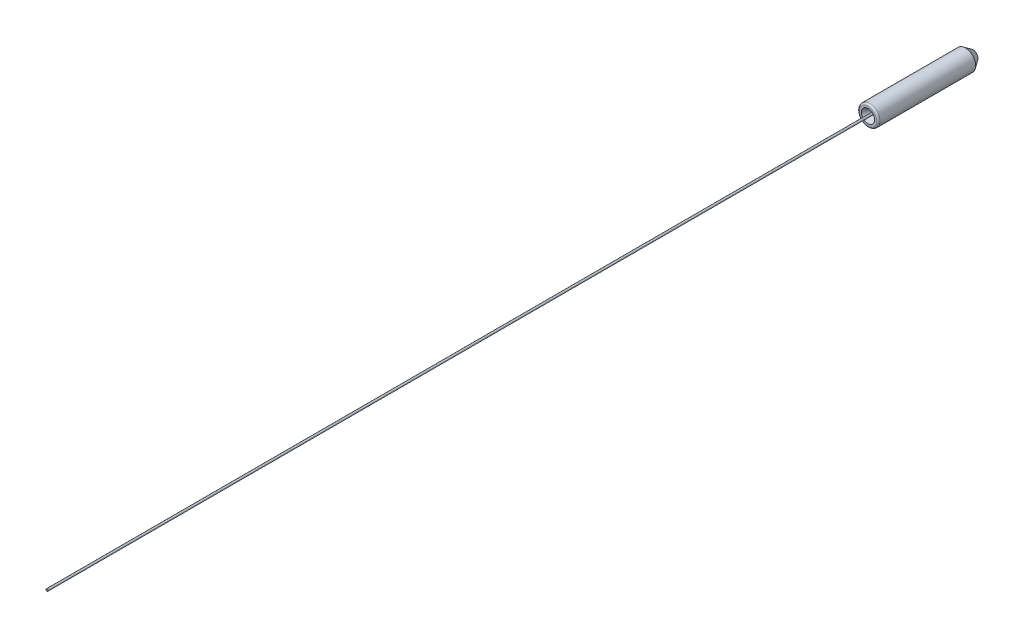
ISO-10303-21;
HEADER;
FILE_DESCRIPTION(('STEP AP214'),'2;1');
FILE_NAME('part.step','',(''),(''),'','','');
FILE_SCHEMA(('AUTOMOTIVE_DESIGN { 1 0 10303 214 1 1 1 1 }'));
ENDSEC;
DATA;
#1=APPLICATION_CONTEXT('core data for automotive mechanical design processes');
#2=APPLICATION_PROTOCOL_DEFINITION('international standard','automotive_design',2000,#1);
#3=PRODUCT_CONTEXT('',#1,'mechanical');
#4=PRODUCT('Part','Part','',(#3));
#5=PRODUCT_RELATED_PRODUCT_CATEGORY('part','',(#4));
#6=PRODUCT_DEFINITION_FORMATION('','',#4);
#7=PRODUCT_DEFINITION_CONTEXT('part definition',#1,'design');
#8=PRODUCT_DEFINITION('design','',#6,#7);
#9=PRODUCT_DEFINITION_SHAPE('','',#8);
#10=(LENGTH_UNIT() NAMED_UNIT(*) SI_UNIT(.MILLI.,.METRE.));
#11=(NAMED_UNIT(*) PLANE_ANGLE_UNIT() SI_UNIT($,.RADIAN.));
#12=(NAMED_UNIT(*) SI_UNIT($,.STERADIAN.) SOLID_ANGLE_UNIT());
#13=UNCERTAINTY_MEASURE_WITH_UNIT(LENGTH_MEASURE(1.E-05),#10,'distance_accuracy_value','');
#14=(GEOMETRIC_REPRESENTATION_CONTEXT(3) GLOBAL_UNCERTAINTY_ASSIGNED_CONTEXT((#13)) GLOBAL_UNIT_ASSIGNED_CONTEXT((#10,
#11,#12)) REPRESENTATION_CONTEXT('',''));
#15=CARTESIAN_POINT('',(0.,0.,0.));
#16=DIRECTION('',(0.,0.,1.));
#17=DIRECTION('',(1.,0.,0.));
#18=AXIS2_PLACEMENT_3D('',#15,#16,#17);
#19=CARTESIAN_POINT('',(0.,0.,-6.4));
#20=DIRECTION('',(0.,0.,1.));
#21=DIRECTION('',(1.,0.,0.));
#22=AXIS2_PLACEMENT_3D('',#19,#20,#21);
#23=CYLINDRICAL_SURFACE('',#22,0.0625);
#24=CARTESIAN_POINT('',(0.,0.,-6.4));
#25=DIRECTION('',(0.,0.,1.));
#26=DIRECTION('',(1.,0.,0.));
#27=AXIS2_PLACEMENT_3D('',#24,#25,#26);
#28=CIRCLE('',#27,0.0625);
#29=CARTESIAN_POINT('',(0.0625,0.,-6.4));
#30=VERTEX_POINT('',#29);
#31=EDGE_CURVE('P0_E10',#30,#30,#28,.T.);
#32=ORIENTED_EDGE('',*,*,#31,.T.);
#33=EDGE_LOOP('',(#32));
#34=FACE_BOUND('',#33,.T.);
#35=CARTESIAN_POINT('',(0.,0.,50.));
#36=DIRECTION('',(0.,0.,1.));
#37=DIRECTION('',(1.,0.,0.));
#38=AXIS2_PLACEMENT_3D('',#35,#36,#37);
#39=CIRCLE('',#38,0.0625);
#40=CARTESIAN_POINT('',(0.0625,0.,50.));
#41=VERTEX_POINT('',#40);
#42=EDGE_CURVE('P0_E17',#41,#41,#39,.T.);
#43=ORIENTED_EDGE('',*,*,#42,.F.);
#44=EDGE_LOOP('',(#43));
#45=FACE_BOUND('',#44,.T.);
#46=ADVANCED_FACE('P0_F14',(#34,#45),#23,.T.);
#47=CARTESIAN_POINT('',(0.,0.,-6.4));
#48=DIRECTION('',(0.,0.,1.));
#49=DIRECTION('',(1.,0.,0.));
#50=AXIS2_PLACEMENT_3D('',#47,#48,#49);
#51=PLANE('',#50);
#52=ORIENTED_EDGE('',*,*,#31,.F.);
#53=EDGE_LOOP('',(#52));
#54=FACE_BOUND('',#53,.T.);
#55=ADVANCED_FACE('P0_F29',(#54),#51,.F.);
#56=CARTESIAN_POINT('',(0.,0.,50.));
#57=DIRECTION('',(0.,0.,1.));
#58=DIRECTION('',(1.,0.,0.));
#59=AXIS2_PLACEMENT_3D('',#56,#57,#58);
#60=PLANE('',#59);
#61=ORIENTED_EDGE('',*,*,#42,.T.);
#62=EDGE_LOOP('',(#61));
#63=FACE_BOUND('',#62,.T.);
#64=ADVANCED_FACE('P0_F26',(#63),#60,.T.);
#65=CLOSED_SHELL('',(#46,#55,#64));
#66=MANIFOLD_SOLID_BREP('P0_B1',#65);
#67=CARTESIAN_POINT('',(0.,0.,-6.4));
#68=DIRECTION('',(0.,0.,1.));
#69=DIRECTION('',(1.,0.,0.));
#70=AXIS2_PLACEMENT_3D('',#67,#68,#69);
#71=CYLINDRICAL_SURFACE('',#70,0.6245);
#72=CARTESIAN_POINT('',(0.,0.,-0.1));
#73=DIRECTION('',(0.,0.,1.));
#74=DIRECTION('',(1.,0.,0.));
#75=AXIS2_PLACEMENT_3D('',#72,#73,#74);
#76=CIRCLE('',#75,0.6245);
#77=CARTESIAN_POINT('',(0.6245,0.,-0.1));
#78=VERTEX_POINT('',#77);
#79=EDGE_CURVE('P1_E9',#78,#78,#76,.F.);
#80=ORIENTED_EDGE('',*,*,#79,.T.);
#81=EDGE_LOOP('',(#80));
#82=FACE_BOUND('',#81,.T.);
#83=CARTESIAN_POINT('',(0.,0.,-5.93585189780881));
#84=DIRECTION('',(0.,0.,1.));
#85=DIRECTION('',(1.,0.,0.));
#86=AXIS2_PLACEMENT_3D('',#83,#84,#85);
#87=CIRCLE('',#86,0.6245);
#88=CARTESIAN_POINT('',(0.6245,0.,-5.93585189780881));
#89=VERTEX_POINT('',#88);
#90=EDGE_CURVE('P1_E28',#89,#89,#87,.T.);
#91=ORIENTED_EDGE('',*,*,#90,.T.);
#92=EDGE_LOOP('',(#91));
#93=FACE_BOUND('',#92,.T.);
#94=ADVANCED_FACE('P1_F13',(#82,#93),#71,.T.);
#95=CARTESIAN_POINT('',(0.,0.,-6.4));
#96=DIRECTION('',(0.,0.,1.));
#97=DIRECTION('',(1.,0.,0.));
#98=AXIS2_PLACEMENT_3D('',#95,#96,#97);
#99=PLANE('',#98);
#100=CARTESIAN_POINT('',(0.,0.,-6.4));
#101=DIRECTION('',(0.,0.,1.));
#102=DIRECTION('',(1.,0.,0.));
#103=AXIS2_PLACEMENT_3D('',#100,#101,#102);
#104=CIRCLE('',#103,0.299499999999999);
#105=CARTESIAN_POINT('',(0.299499999999999,0.,-6.4));
#106=VERTEX_POINT('',#105);
#107=EDGE_CURVE('P1_E24',#106,#106,#104,.F.);
#108=ORIENTED_EDGE('',*,*,#107,.T.);
#109=EDGE_LOOP('',(#108));
#110=FACE_BOUND('',#109,.T.);
#111=CARTESIAN_POINT('',(0.,0.,-6.4));
#112=DIRECTION('',(0.,0.,-1.));
#113=DIRECTION('',(-1.,0.,0.));
#114=AXIS2_PLACEMENT_3D('',#111,#112,#113);
#115=CIRCLE('',#114,0.063);
#116=CARTESIAN_POINT('',(-0.063,0.,-6.4));
#117=VERTEX_POINT('',#116);
#118=EDGE_CURVE('P1_E42',#117,#117,#115,.T.);
#119=ORIENTED_EDGE('',*,*,#118,.F.);
#120=EDGE_LOOP('',(#119));
#121=FACE_BOUND('',#120,.T.);
#122=ADVANCED_FACE('P1_F48',(#110,#121),#99,.F.);
#123=CARTESIAN_POINT('',(0.,0.,0.));
#124=DIRECTION('',(0.,0.,1.));
#125=DIRECTION('',(1.,0.,0.));
#126=AXIS2_PLACEMENT_3D('',#123,#124,#125);
#127=PLANE('',#126);
#128=CARTESIAN_POINT('',(0.,0.,0.));
#129=DIRECTION('',(0.,0.,1.));
#130=DIRECTION('',(1.,0.,0.));
#131=AXIS2_PLACEMENT_3D('',#128,#129,#130);
#132=CIRCLE('',#131,0.5245);
#133=CARTESIAN_POINT('',(0.5245,0.,0.));
#134=VERTEX_POINT('',#133);
#135=EDGE_CURVE('P1_E20',#134,#134,#132,.T.);
#136=ORIENTED_EDGE('',*,*,#135,.T.);
#137=EDGE_LOOP('',(#136));
#138=FACE_BOUND('',#137,.T.);
#139=CARTESIAN_POINT('',(0.,0.,0.));
#140=DIRECTION('',(0.,0.,-1.));
#141=DIRECTION('',(-1.,0.,0.));
#142=AXIS2_PLACEMENT_3D('',#139,#140,#141);
#143=CIRCLE('',#142,0.4);
#144=CARTESIAN_POINT('',(-0.4,0.,0.));
#145=VERTEX_POINT('',#144);
#146=EDGE_CURVE('P1_E33',#145,#145,#143,.T.);
#147=ORIENTED_EDGE('',*,*,#146,.T.);
#148=EDGE_LOOP('',(#147));
#149=FACE_BOUND('',#148,.T.);
#150=ADVANCED_FACE('P1_F50',(#138,#149),#127,.T.);
#151=CARTESIAN_POINT('',(0.,0.,-0.537290960636936));
#152=DIRECTION('',(0.,0.,1.));
#153=DIRECTION('',(1.,0.,0.));
#154=AXIS2_PLACEMENT_3D('',#151,#152,#153);
#155=CONICAL_SURFACE('',#154,0.0897949192431117,0.5235987755983);
#156=ORIENTED_EDGE('',*,*,#146,.F.);
#157=EDGE_LOOP('',(#156));
#158=FACE_BOUND('',#157,.T.);
#159=CARTESIAN_POINT('',(0.,0.,-0.537290960636936));
#160=DIRECTION('',(0.,0.,-1.));
#161=DIRECTION('',(-1.,0.,0.));
#162=AXIS2_PLACEMENT_3D('',#159,#160,#161);
#163=CIRCLE('',#162,0.0897949192431117);
#164=CARTESIAN_POINT('',(-0.0897949192431117,0.,-0.537290960636936));
#165=VERTEX_POINT('',#164);
#166=EDGE_CURVE('P1_E36',#165,#165,#163,.T.);
#167=ORIENTED_EDGE('',*,*,#166,.T.);
#168=EDGE_LOOP('',(#167));
#169=FACE_BOUND('',#168,.T.);
#170=ADVANCED_FACE('P1_F58',(#158,#169),#155,.F.);
#171=CARTESIAN_POINT('',(0.,0.,-0.637290960636936));
#172=DIRECTION('',(0.,0.,-1.));
#173=DIRECTION('',(-1.,0.,0.));
#174=AXIS2_PLACEMENT_3D('',#171,#172,#173);
#175=TOROIDAL_SURFACE('',#174,0.262999999999999,0.2);
#176=ORIENTED_EDGE('',*,*,#166,.F.);
#177=EDGE_LOOP('',(#176));
#178=FACE_BOUND('',#177,.T.);
#179=CARTESIAN_POINT('',(0.,0.,-0.637290960636937));
#180=DIRECTION('',(0.,0.,-1.));
#181=DIRECTION('',(-1.,0.,0.));
#182=AXIS2_PLACEMENT_3D('',#179,#180,#181);
#183=CIRCLE('',#182,0.0629999999999993);
#184=CARTESIAN_POINT('',(-0.0629999999999993,0.,-0.637290960636937));
#185=VERTEX_POINT('',#184);
#186=EDGE_CURVE('P1_E39',#185,#185,#183,.T.);
#187=ORIENTED_EDGE('',*,*,#186,.T.);
#188=EDGE_LOOP('',(#187));
#189=FACE_BOUND('',#188,.T.);
#190=ADVANCED_FACE('P1_F71',(#178,#189),#175,.T.);
#191=CARTESIAN_POINT('',(0.,0.,-13.136975719544));
#192=DIRECTION('',(0.,0.,-1.));
#193=DIRECTION('',(-1.,0.,0.));
#194=AXIS2_PLACEMENT_3D('',#191,#192,#193);
#195=CYLINDRICAL_SURFACE('',#194,0.0629999999999997);
#196=ORIENTED_EDGE('',*,*,#186,.F.);
#197=EDGE_LOOP('',(#196));
#198=FACE_BOUND('',#197,.T.);
#199=ORIENTED_EDGE('',*,*,#118,.T.);
#200=EDGE_LOOP('',(#199));
#201=FACE_BOUND('',#200,.T.);
#202=ADVANCED_FACE('P1_F46',(#198,#201),#195,.F.);
#203=CARTESIAN_POINT('',(0.,0.,-5.93585189780881));
#204=DIRECTION('',(0.,0.,1.));
#205=DIRECTION('',(1.,0.,0.));
#206=AXIS2_PLACEMENT_3D('',#203,#204,#205);
#207=CONICAL_SURFACE('',#206,0.6245,0.610865238198017);
#208=ORIENTED_EDGE('',*,*,#107,.F.);
#209=EDGE_LOOP('',(#208));
#210=FACE_BOUND('',#209,.T.);
#211=ORIENTED_EDGE('',*,*,#90,.F.);
#212=EDGE_LOOP('',(#211));
#213=FACE_BOUND('',#212,.T.);
#214=ADVANCED_FACE('P1_F63',(#210,#213),#207,.T.);
#215=CARTESIAN_POINT('',(0.,0.,-0.1));
#216=DIRECTION('',(0.,0.,1.));
#217=DIRECTION('',(1.,0.,0.));
#218=AXIS2_PLACEMENT_3D('',#215,#216,#217);
#219=TOROIDAL_SURFACE('',#218,0.5245,0.1);
#220=ORIENTED_EDGE('',*,*,#79,.F.);
#221=EDGE_LOOP('',(#220));
#222=FACE_BOUND('',#221,.T.);
#223=ORIENTED_EDGE('',*,*,#135,.F.);
#224=EDGE_LOOP('',(#223));
#225=FACE_BOUND('',#224,.T.);
#226=ADVANCED_FACE('P1_F15',(#222,#225),#219,.T.);
#227=CLOSED_SHELL('',(#94,#122,#150,#170,#190,#202,#214,#226));
#228=MANIFOLD_SOLID_BREP('P1_B1',#227);
#229=ADVANCED_BREP_SHAPE_REPRESENTATION('',(#18,#66,#228),#14);
#230=SHAPE_DEFINITION_REPRESENTATION(#9,#229);
ENDSEC;
END-ISO-10303-21;
